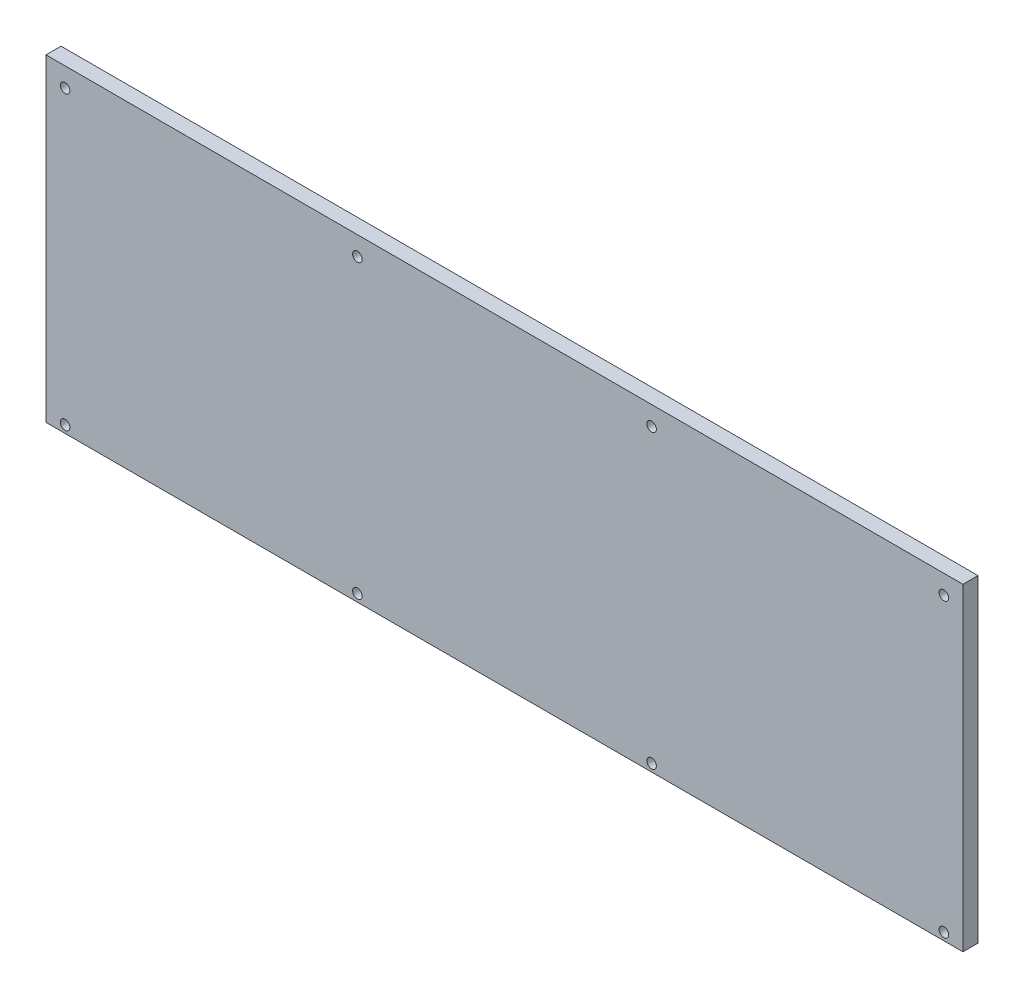
ISO-10303-21;
HEADER;
FILE_DESCRIPTION(('STEP AP214'),'2;1');
FILE_NAME('part.step','',(''),(''),'','','');
FILE_SCHEMA(('AUTOMOTIVE_DESIGN { 1 0 10303 214 1 1 1 1 }'));
ENDSEC;
DATA;
#1=APPLICATION_CONTEXT('core data for automotive mechanical design processes');
#2=APPLICATION_PROTOCOL_DEFINITION('international standard','automotive_design',2000,#1);
#3=PRODUCT_CONTEXT('',#1,'mechanical');
#4=PRODUCT('Part','Part','',(#3));
#5=PRODUCT_RELATED_PRODUCT_CATEGORY('part','',(#4));
#6=PRODUCT_DEFINITION_FORMATION('','',#4);
#7=PRODUCT_DEFINITION_CONTEXT('part definition',#1,'design');
#8=PRODUCT_DEFINITION('design','',#6,#7);
#9=PRODUCT_DEFINITION_SHAPE('','',#8);
#10=(LENGTH_UNIT() NAMED_UNIT(*) SI_UNIT(.MILLI.,.METRE.));
#11=(NAMED_UNIT(*) PLANE_ANGLE_UNIT() SI_UNIT($,.RADIAN.));
#12=(NAMED_UNIT(*) SI_UNIT($,.STERADIAN.) SOLID_ANGLE_UNIT());
#13=UNCERTAINTY_MEASURE_WITH_UNIT(LENGTH_MEASURE(1.E-05),#10,'distance_accuracy_value','');
#14=(GEOMETRIC_REPRESENTATION_CONTEXT(3) GLOBAL_UNCERTAINTY_ASSIGNED_CONTEXT((#13)) GLOBAL_UNIT_ASSIGNED_CONTEXT((#10,
#11,#12)) REPRESENTATION_CONTEXT('',''));
#15=CARTESIAN_POINT('',(0.,0.,0.));
#16=DIRECTION('',(0.,0.,1.));
#17=DIRECTION('',(1.,0.,0.));
#18=AXIS2_PLACEMENT_3D('',#15,#16,#17);
#19=CARTESIAN_POINT('',(0.,0.,0.));
#20=DIRECTION('',(0.,0.,1.));
#21=DIRECTION('',(1.,0.,0.));
#22=AXIS2_PLACEMENT_3D('',#19,#20,#21);
#23=PLANE('',#22);
#24=DIRECTION('',(1.,0.,0.));
#25=VECTOR('',#24,1.);
#26=CARTESIAN_POINT('',(0.,105.815007519216,0.));
#27=LINE('',#26,#25);
#28=CARTESIAN_POINT('',(0.,105.815007519216,0.));
#29=VERTEX_POINT('',#28);
#30=CARTESIAN_POINT('',(304.800000000001,105.815007519216,0.));
#31=VERTEX_POINT('',#30);
#32=EDGE_CURVE('E107',#29,#31,#27,.T.);
#33=ORIENTED_EDGE('',*,*,#32,.T.);
#34=DIRECTION('',(0.,-1.,0.));
#35=VECTOR('',#34,1.);
#36=CARTESIAN_POINT('',(304.800000000002,105.815007519216,0.));
#37=LINE('',#36,#35);
#38=CARTESIAN_POINT('',(304.8,0.,0.));
#39=VERTEX_POINT('',#38);
#40=EDGE_CURVE('E71',#31,#39,#37,.T.);
#41=ORIENTED_EDGE('',*,*,#40,.T.);
#42=DIRECTION('',(1.,0.,0.));
#43=VECTOR('',#42,1.);
#44=CARTESIAN_POINT('',(0.,0.,0.));
#45=LINE('',#44,#43);
#46=CARTESIAN_POINT('',(0.,0.,0.));
#47=VERTEX_POINT('',#46);
#48=EDGE_CURVE('E54',#39,#47,#45,.F.);
#49=ORIENTED_EDGE('',*,*,#48,.T.);
#50=DIRECTION('',(0.,1.,0.));
#51=VECTOR('',#50,1.);
#52=CARTESIAN_POINT('',(0.,105.815007519216,0.));
#53=LINE('',#52,#51);
#54=EDGE_CURVE('E59',#47,#29,#53,.T.);
#55=ORIENTED_EDGE('',*,*,#54,.T.);
#56=EDGE_LOOP('',(#33,#41,#49,#55));
#57=FACE_BOUND('',#56,.T.);
#58=CARTESIAN_POINT('',(6.34999999999991,99.4650075192159,0.));
#59=DIRECTION('',(0.,0.,1.));
#60=DIRECTION('',(1.,0.,0.));
#61=AXIS2_PLACEMENT_3D('',#58,#59,#60);
#62=CIRCLE('',#61,1.58750000000003);
#63=CARTESIAN_POINT('',(7.93749999999994,99.4650075192159,0.));
#64=VERTEX_POINT('',#63);
#65=EDGE_CURVE('E68',#64,#64,#62,.T.);
#66=ORIENTED_EDGE('',*,*,#65,.T.);
#67=EDGE_LOOP('',(#66));
#68=FACE_BOUND('',#67,.T.);
#69=CARTESIAN_POINT('',(6.34999999999994,2.49999999999995,0.));
#70=DIRECTION('',(0.,0.,1.));
#71=DIRECTION('',(1.,0.,0.));
#72=AXIS2_PLACEMENT_3D('',#69,#70,#71);
#73=CIRCLE('',#72,1.58749999999994);
#74=CARTESIAN_POINT('',(7.93749999999988,2.49999999999995,0.));
#75=VERTEX_POINT('',#74);
#76=EDGE_CURVE('E110',#75,#75,#73,.T.);
#77=ORIENTED_EDGE('',*,*,#76,.T.);
#78=EDGE_LOOP('',(#77));
#79=FACE_BOUND('',#78,.T.);
#80=CARTESIAN_POINT('',(103.505,2.49999999999995,0.));
#81=DIRECTION('',(0.,0.,1.));
#82=DIRECTION('',(1.,0.,0.));
#83=AXIS2_PLACEMENT_3D('',#80,#81,#82);
#84=CIRCLE('',#83,1.58750000000001);
#85=CARTESIAN_POINT('',(105.0925,2.49999999999995,0.));
#86=VERTEX_POINT('',#85);
#87=EDGE_CURVE('E113',#86,#86,#84,.T.);
#88=ORIENTED_EDGE('',*,*,#87,.T.);
#89=EDGE_LOOP('',(#88));
#90=FACE_BOUND('',#89,.T.);
#91=CARTESIAN_POINT('',(103.505,99.4650075192159,0.));
#92=DIRECTION('',(0.,0.,1.));
#93=DIRECTION('',(1.,0.,0.));
#94=AXIS2_PLACEMENT_3D('',#91,#92,#93);
#95=CIRCLE('',#94,1.58749999999999);
#96=CARTESIAN_POINT('',(105.0925,99.4650075192159,0.));
#97=VERTEX_POINT('',#96);
#98=EDGE_CURVE('E116',#97,#97,#95,.T.);
#99=ORIENTED_EDGE('',*,*,#98,.T.);
#100=EDGE_LOOP('',(#99));
#101=FACE_BOUND('',#100,.T.);
#102=CARTESIAN_POINT('',(201.295,99.4650075192159,0.));
#103=DIRECTION('',(0.,0.,1.));
#104=DIRECTION('',(1.,0.,0.));
#105=AXIS2_PLACEMENT_3D('',#102,#103,#104);
#106=CIRCLE('',#105,1.58750000000002);
#107=CARTESIAN_POINT('',(202.8825,99.4650075192159,0.));
#108=VERTEX_POINT('',#107);
#109=EDGE_CURVE('E119',#108,#108,#106,.T.);
#110=ORIENTED_EDGE('',*,*,#109,.T.);
#111=EDGE_LOOP('',(#110));
#112=FACE_BOUND('',#111,.T.);
#113=CARTESIAN_POINT('',(201.295,2.49999999999996,0.));
#114=DIRECTION('',(0.,0.,1.));
#115=DIRECTION('',(1.,0.,0.));
#116=AXIS2_PLACEMENT_3D('',#113,#114,#115);
#117=CIRCLE('',#116,1.58750000000002);
#118=CARTESIAN_POINT('',(202.8825,2.49999999999996,0.));
#119=VERTEX_POINT('',#118);
#120=EDGE_CURVE('E122',#119,#119,#117,.T.);
#121=ORIENTED_EDGE('',*,*,#120,.T.);
#122=EDGE_LOOP('',(#121));
#123=FACE_BOUND('',#122,.T.);
#124=CARTESIAN_POINT('',(298.45,2.49999999999998,0.));
#125=DIRECTION('',(0.,0.,1.));
#126=DIRECTION('',(1.,0.,0.));
#127=AXIS2_PLACEMENT_3D('',#124,#125,#126);
#128=CIRCLE('',#127,1.58750000000002);
#129=CARTESIAN_POINT('',(300.0375,2.49999999999998,0.));
#130=VERTEX_POINT('',#129);
#131=EDGE_CURVE('E124',#130,#130,#128,.T.);
#132=ORIENTED_EDGE('',*,*,#131,.T.);
#133=EDGE_LOOP('',(#132));
#134=FACE_BOUND('',#133,.T.);
#135=CARTESIAN_POINT('',(298.45,99.4650075192159,0.));
#136=DIRECTION('',(0.,0.,1.));
#137=DIRECTION('',(1.,0.,0.));
#138=AXIS2_PLACEMENT_3D('',#135,#136,#137);
#139=CIRCLE('',#138,1.58750000000002);
#140=CARTESIAN_POINT('',(300.0375,99.4650075192159,0.));
#141=VERTEX_POINT('',#140);
#142=EDGE_CURVE('E19',#141,#141,#139,.T.);
#143=ORIENTED_EDGE('',*,*,#142,.T.);
#144=EDGE_LOOP('',(#143));
#145=FACE_BOUND('',#144,.T.);
#146=ADVANCED_FACE('F16',(#57,#68,#79,#90,#101,#112,#123,#134,#145),#23,.F.);
#147=CARTESIAN_POINT('',(298.45,99.4650075192159,0.));
#148=DIRECTION('',(0.,0.,1.));
#149=DIRECTION('',(1.,0.,0.));
#150=AXIS2_PLACEMENT_3D('',#147,#148,#149);
#151=CYLINDRICAL_SURFACE('',#150,1.58750000000002);
#152=CARTESIAN_POINT('',(298.45,99.4650075192159,5.));
#153=DIRECTION('',(0.,0.,1.));
#154=DIRECTION('',(1.,0.,0.));
#155=AXIS2_PLACEMENT_3D('',#152,#153,#154);
#156=CIRCLE('',#155,1.58750000000002);
#157=CARTESIAN_POINT('',(300.0375,99.4650075192159,5.));
#158=VERTEX_POINT('',#157);
#159=EDGE_CURVE('E104',#158,#158,#156,.F.);
#160=ORIENTED_EDGE('',*,*,#159,.F.);
#161=EDGE_LOOP('',(#160));
#162=FACE_BOUND('',#161,.T.);
#163=ORIENTED_EDGE('',*,*,#142,.F.);
#164=EDGE_LOOP('',(#163));
#165=FACE_BOUND('',#164,.T.);
#166=ADVANCED_FACE('F132',(#162,#165),#151,.F.);
#167=CARTESIAN_POINT('',(298.45,2.49999999999998,0.));
#168=DIRECTION('',(0.,0.,1.));
#169=DIRECTION('',(1.,0.,0.));
#170=AXIS2_PLACEMENT_3D('',#167,#168,#169);
#171=CYLINDRICAL_SURFACE('',#170,1.58750000000002);
#172=CARTESIAN_POINT('',(298.45,2.49999999999998,5.));
#173=DIRECTION('',(0.,0.,1.));
#174=DIRECTION('',(1.,0.,0.));
#175=AXIS2_PLACEMENT_3D('',#172,#173,#174);
#176=CIRCLE('',#175,1.58750000000002);
#177=CARTESIAN_POINT('',(300.0375,2.49999999999998,5.));
#178=VERTEX_POINT('',#177);
#179=EDGE_CURVE('E101',#178,#178,#176,.F.);
#180=ORIENTED_EDGE('',*,*,#179,.F.);
#181=EDGE_LOOP('',(#180));
#182=FACE_BOUND('',#181,.T.);
#183=ORIENTED_EDGE('',*,*,#131,.F.);
#184=EDGE_LOOP('',(#183));
#185=FACE_BOUND('',#184,.T.);
#186=ADVANCED_FACE('F134',(#182,#185),#171,.F.);
#187=CARTESIAN_POINT('',(201.295,2.49999999999996,0.));
#188=DIRECTION('',(0.,0.,1.));
#189=DIRECTION('',(1.,0.,0.));
#190=AXIS2_PLACEMENT_3D('',#187,#188,#189);
#191=CYLINDRICAL_SURFACE('',#190,1.58750000000002);
#192=CARTESIAN_POINT('',(201.295,2.49999999999996,5.));
#193=DIRECTION('',(0.,0.,1.));
#194=DIRECTION('',(1.,0.,0.));
#195=AXIS2_PLACEMENT_3D('',#192,#193,#194);
#196=CIRCLE('',#195,1.58750000000002);
#197=CARTESIAN_POINT('',(202.8825,2.49999999999996,5.));
#198=VERTEX_POINT('',#197);
#199=EDGE_CURVE('E98',#198,#198,#196,.F.);
#200=ORIENTED_EDGE('',*,*,#199,.F.);
#201=EDGE_LOOP('',(#200));
#202=FACE_BOUND('',#201,.T.);
#203=ORIENTED_EDGE('',*,*,#120,.F.);
#204=EDGE_LOOP('',(#203));
#205=FACE_BOUND('',#204,.T.);
#206=ADVANCED_FACE('F142',(#202,#205),#191,.F.);
#207=CARTESIAN_POINT('',(201.295,99.4650075192159,0.));
#208=DIRECTION('',(0.,0.,1.));
#209=DIRECTION('',(1.,0.,0.));
#210=AXIS2_PLACEMENT_3D('',#207,#208,#209);
#211=CYLINDRICAL_SURFACE('',#210,1.58750000000002);
#212=CARTESIAN_POINT('',(201.295,99.4650075192159,5.));
#213=DIRECTION('',(0.,0.,1.));
#214=DIRECTION('',(1.,0.,0.));
#215=AXIS2_PLACEMENT_3D('',#212,#213,#214);
#216=CIRCLE('',#215,1.58750000000002);
#217=CARTESIAN_POINT('',(202.8825,99.4650075192159,5.));
#218=VERTEX_POINT('',#217);
#219=EDGE_CURVE('E95',#218,#218,#216,.F.);
#220=ORIENTED_EDGE('',*,*,#219,.F.);
#221=EDGE_LOOP('',(#220));
#222=FACE_BOUND('',#221,.T.);
#223=ORIENTED_EDGE('',*,*,#109,.F.);
#224=EDGE_LOOP('',(#223));
#225=FACE_BOUND('',#224,.T.);
#226=ADVANCED_FACE('F182',(#222,#225),#211,.F.);
#227=CARTESIAN_POINT('',(103.505,99.4650075192159,0.));
#228=DIRECTION('',(0.,0.,1.));
#229=DIRECTION('',(1.,0.,0.));
#230=AXIS2_PLACEMENT_3D('',#227,#228,#229);
#231=CYLINDRICAL_SURFACE('',#230,1.58749999999999);
#232=CARTESIAN_POINT('',(103.505,99.4650075192159,5.));
#233=DIRECTION('',(0.,0.,1.));
#234=DIRECTION('',(1.,0.,0.));
#235=AXIS2_PLACEMENT_3D('',#232,#233,#234);
#236=CIRCLE('',#235,1.58749999999999);
#237=CARTESIAN_POINT('',(105.0925,99.4650075192159,5.));
#238=VERTEX_POINT('',#237);
#239=EDGE_CURVE('E92',#238,#238,#236,.F.);
#240=ORIENTED_EDGE('',*,*,#239,.F.);
#241=EDGE_LOOP('',(#240));
#242=FACE_BOUND('',#241,.T.);
#243=ORIENTED_EDGE('',*,*,#98,.F.);
#244=EDGE_LOOP('',(#243));
#245=FACE_BOUND('',#244,.T.);
#246=ADVANCED_FACE('F178',(#242,#245),#231,.F.);
#247=CARTESIAN_POINT('',(103.505,2.49999999999995,0.));
#248=DIRECTION('',(0.,0.,1.));
#249=DIRECTION('',(1.,0.,0.));
#250=AXIS2_PLACEMENT_3D('',#247,#248,#249);
#251=CYLINDRICAL_SURFACE('',#250,1.58750000000001);
#252=CARTESIAN_POINT('',(103.505,2.49999999999995,5.));
#253=DIRECTION('',(0.,0.,1.));
#254=DIRECTION('',(1.,0.,0.));
#255=AXIS2_PLACEMENT_3D('',#252,#253,#254);
#256=CIRCLE('',#255,1.58750000000001);
#257=CARTESIAN_POINT('',(105.0925,2.49999999999995,5.));
#258=VERTEX_POINT('',#257);
#259=EDGE_CURVE('E89',#258,#258,#256,.F.);
#260=ORIENTED_EDGE('',*,*,#259,.F.);
#261=EDGE_LOOP('',(#260));
#262=FACE_BOUND('',#261,.T.);
#263=ORIENTED_EDGE('',*,*,#87,.F.);
#264=EDGE_LOOP('',(#263));
#265=FACE_BOUND('',#264,.T.);
#266=ADVANCED_FACE('F174',(#262,#265),#251,.F.);
#267=CARTESIAN_POINT('',(6.34999999999994,2.49999999999995,0.));
#268=DIRECTION('',(0.,0.,1.));
#269=DIRECTION('',(1.,0.,0.));
#270=AXIS2_PLACEMENT_3D('',#267,#268,#269);
#271=CYLINDRICAL_SURFACE('',#270,1.58749999999994);
#272=CARTESIAN_POINT('',(6.34999999999994,2.49999999999995,5.));
#273=DIRECTION('',(0.,0.,1.));
#274=DIRECTION('',(1.,0.,0.));
#275=AXIS2_PLACEMENT_3D('',#272,#273,#274);
#276=CIRCLE('',#275,1.58749999999994);
#277=CARTESIAN_POINT('',(7.93749999999988,2.49999999999995,5.));
#278=VERTEX_POINT('',#277);
#279=EDGE_CURVE('E86',#278,#278,#276,.F.);
#280=ORIENTED_EDGE('',*,*,#279,.F.);
#281=EDGE_LOOP('',(#280));
#282=FACE_BOUND('',#281,.T.);
#283=ORIENTED_EDGE('',*,*,#76,.F.);
#284=EDGE_LOOP('',(#283));
#285=FACE_BOUND('',#284,.T.);
#286=ADVANCED_FACE('F170',(#282,#285),#271,.F.);
#287=CARTESIAN_POINT('',(6.34999999999991,99.4650075192159,0.));
#288=DIRECTION('',(0.,0.,1.));
#289=DIRECTION('',(1.,0.,0.));
#290=AXIS2_PLACEMENT_3D('',#287,#288,#289);
#291=CYLINDRICAL_SURFACE('',#290,1.58750000000003);
#292=CARTESIAN_POINT('',(6.34999999999991,99.4650075192159,5.));
#293=DIRECTION('',(0.,0.,1.));
#294=DIRECTION('',(1.,0.,0.));
#295=AXIS2_PLACEMENT_3D('',#292,#293,#294);
#296=CIRCLE('',#295,1.58750000000003);
#297=CARTESIAN_POINT('',(7.93749999999994,99.4650075192159,5.));
#298=VERTEX_POINT('',#297);
#299=EDGE_CURVE('E82',#298,#298,#296,.F.);
#300=ORIENTED_EDGE('',*,*,#299,.F.);
#301=EDGE_LOOP('',(#300));
#302=FACE_BOUND('',#301,.T.);
#303=ORIENTED_EDGE('',*,*,#65,.F.);
#304=EDGE_LOOP('',(#303));
#305=FACE_BOUND('',#304,.T.);
#306=ADVANCED_FACE('F167',(#302,#305),#291,.F.);
#307=CARTESIAN_POINT('',(0.,105.815007519216,5.));
#308=DIRECTION('',(1.,0.,0.));
#309=DIRECTION('',(0.,1.,0.));
#310=AXIS2_PLACEMENT_3D('',#307,#308,#309);
#311=PLANE('',#310);
#312=DIRECTION('',(0.,0.,1.));
#313=VECTOR('',#312,1.);
#314=CARTESIAN_POINT('',(0.,0.,5.));
#315=LINE('',#314,#313);
#316=CARTESIAN_POINT('',(0.,0.,5.));
#317=VERTEX_POINT('',#316);
#318=EDGE_CURVE('E61',#47,#317,#315,.T.);
#319=ORIENTED_EDGE('',*,*,#318,.T.);
#320=DIRECTION('',(0.,1.,0.));
#321=VECTOR('',#320,1.);
#322=CARTESIAN_POINT('',(0.,0.,5.));
#323=LINE('',#322,#321);
#324=CARTESIAN_POINT('',(0.,105.815007519216,5.));
#325=VERTEX_POINT('',#324);
#326=EDGE_CURVE('E85',#325,#317,#323,.F.);
#327=ORIENTED_EDGE('',*,*,#326,.F.);
#328=DIRECTION('',(0.,0.,-1.));
#329=VECTOR('',#328,1.);
#330=CARTESIAN_POINT('',(0.,105.815007519216,5.));
#331=LINE('',#330,#329);
#332=EDGE_CURVE('E64',#325,#29,#331,.T.);
#333=ORIENTED_EDGE('',*,*,#332,.T.);
#334=ORIENTED_EDGE('',*,*,#54,.F.);
#335=EDGE_LOOP('',(#319,#327,#333,#334));
#336=FACE_BOUND('',#335,.T.);
#337=ADVANCED_FACE('F60',(#336),#311,.F.);
#338=CARTESIAN_POINT('',(0.,0.,5.));
#339=DIRECTION('',(0.,1.,0.));
#340=DIRECTION('',(0.,0.,1.));
#341=AXIS2_PLACEMENT_3D('',#338,#339,#340);
#342=PLANE('',#341);
#343=DIRECTION('',(0.,0.,1.));
#344=VECTOR('',#343,1.);
#345=CARTESIAN_POINT('',(304.8,0.,5.));
#346=LINE('',#345,#344);
#347=CARTESIAN_POINT('',(304.8,0.,5.));
#348=VERTEX_POINT('',#347);
#349=EDGE_CURVE('E73',#39,#348,#346,.T.);
#350=ORIENTED_EDGE('',*,*,#349,.T.);
#351=DIRECTION('',(1.,0.,0.));
#352=VECTOR('',#351,1.);
#353=CARTESIAN_POINT('',(0.,0.,5.));
#354=LINE('',#353,#352);
#355=EDGE_CURVE('E77',#317,#348,#354,.T.);
#356=ORIENTED_EDGE('',*,*,#355,.F.);
#357=ORIENTED_EDGE('',*,*,#318,.F.);
#358=ORIENTED_EDGE('',*,*,#48,.F.);
#359=EDGE_LOOP('',(#350,#356,#357,#358));
#360=FACE_BOUND('',#359,.T.);
#361=ADVANCED_FACE('F75',(#360),#342,.F.);
#362=CARTESIAN_POINT('',(304.800000000002,105.815007519216,5.));
#363=DIRECTION('',(-1.,0.,0.));
#364=DIRECTION('',(0.,-1.,0.));
#365=AXIS2_PLACEMENT_3D('',#362,#363,#364);
#366=PLANE('',#365);
#367=DIRECTION('',(0.,0.,-1.));
#368=VECTOR('',#367,1.);
#369=CARTESIAN_POINT('',(304.800000000002,105.815007519216,5.));
#370=LINE('',#369,#368);
#371=CARTESIAN_POINT('',(304.800000000001,105.815007519216,5.));
#372=VERTEX_POINT('',#371);
#373=EDGE_CURVE('E34',#31,#372,#370,.F.);
#374=ORIENTED_EDGE('',*,*,#373,.T.);
#375=DIRECTION('',(0.,1.,0.));
#376=VECTOR('',#375,1.);
#377=CARTESIAN_POINT('',(304.8,0.,5.));
#378=LINE('',#377,#376);
#379=EDGE_CURVE('E25',#348,#372,#378,.T.);
#380=ORIENTED_EDGE('',*,*,#379,.F.);
#381=ORIENTED_EDGE('',*,*,#349,.F.);
#382=ORIENTED_EDGE('',*,*,#40,.F.);
#383=EDGE_LOOP('',(#374,#380,#381,#382));
#384=FACE_BOUND('',#383,.T.);
#385=ADVANCED_FACE('F155',(#384),#366,.F.);
#386=CARTESIAN_POINT('',(0.,105.815007519216,5.));
#387=DIRECTION('',(0.,-1.,0.));
#388=DIRECTION('',(0.,0.,-1.));
#389=AXIS2_PLACEMENT_3D('',#386,#387,#388);
#390=PLANE('',#389);
#391=ORIENTED_EDGE('',*,*,#332,.F.);
#392=DIRECTION('',(1.,0.,0.));
#393=VECTOR('',#392,1.);
#394=CARTESIAN_POINT('',(0.,105.815007519216,5.));
#395=LINE('',#394,#393);
#396=EDGE_CURVE('E11',#372,#325,#395,.F.);
#397=ORIENTED_EDGE('',*,*,#396,.F.);
#398=ORIENTED_EDGE('',*,*,#373,.F.);
#399=ORIENTED_EDGE('',*,*,#32,.F.);
#400=EDGE_LOOP('',(#391,#397,#398,#399));
#401=FACE_BOUND('',#400,.T.);
#402=ADVANCED_FACE('F148',(#401),#390,.F.);
#403=CARTESIAN_POINT('',(0.,0.,5.));
#404=DIRECTION('',(0.,0.,1.));
#405=DIRECTION('',(1.,0.,0.));
#406=AXIS2_PLACEMENT_3D('',#403,#404,#405);
#407=PLANE('',#406);
#408=ORIENTED_EDGE('',*,*,#379,.T.);
#409=ORIENTED_EDGE('',*,*,#396,.T.);
#410=ORIENTED_EDGE('',*,*,#326,.T.);
#411=ORIENTED_EDGE('',*,*,#355,.T.);
#412=EDGE_LOOP('',(#408,#409,#410,#411));
#413=FACE_BOUND('',#412,.T.);
#414=ORIENTED_EDGE('',*,*,#299,.T.);
#415=EDGE_LOOP('',(#414));
#416=FACE_BOUND('',#415,.T.);
#417=ORIENTED_EDGE('',*,*,#279,.T.);
#418=EDGE_LOOP('',(#417));
#419=FACE_BOUND('',#418,.T.);
#420=ORIENTED_EDGE('',*,*,#259,.T.);
#421=EDGE_LOOP('',(#420));
#422=FACE_BOUND('',#421,.T.);
#423=ORIENTED_EDGE('',*,*,#239,.T.);
#424=EDGE_LOOP('',(#423));
#425=FACE_BOUND('',#424,.T.);
#426=ORIENTED_EDGE('',*,*,#219,.T.);
#427=EDGE_LOOP('',(#426));
#428=FACE_BOUND('',#427,.T.);
#429=ORIENTED_EDGE('',*,*,#199,.T.);
#430=EDGE_LOOP('',(#429));
#431=FACE_BOUND('',#430,.T.);
#432=ORIENTED_EDGE('',*,*,#179,.T.);
#433=EDGE_LOOP('',(#432));
#434=FACE_BOUND('',#433,.T.);
#435=ORIENTED_EDGE('',*,*,#159,.T.);
#436=EDGE_LOOP('',(#435));
#437=FACE_BOUND('',#436,.T.);
#438=ADVANCED_FACE('F146',(#413,#416,#419,#422,#425,#428,#431,#434,#437),#407,.T.);
#439=CLOSED_SHELL('',(#146,#166,#186,#206,#226,#246,#266,#286,#306,#337,#361,#385,#402,#438));
#440=MANIFOLD_SOLID_BREP('B1',#439);
#441=ADVANCED_BREP_SHAPE_REPRESENTATION('',(#18,#440),#14);
#442=SHAPE_DEFINITION_REPRESENTATION(#9,#441);
ENDSEC;
END-ISO-10303-21;
